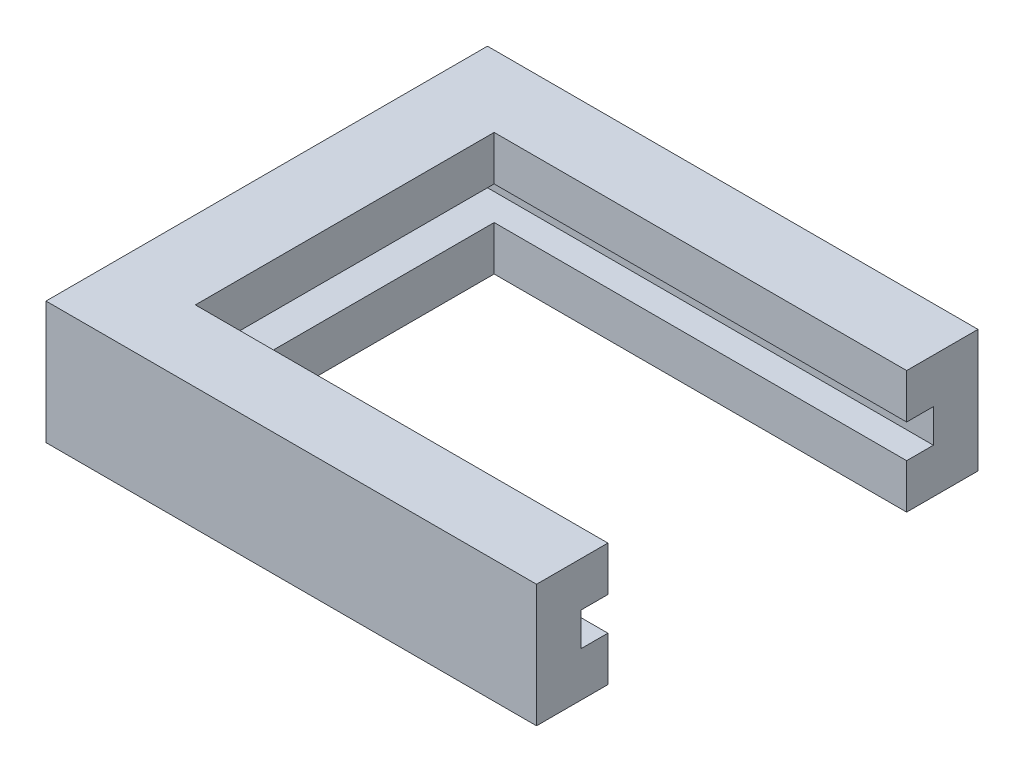
ISO-10303-21;
HEADER;
FILE_DESCRIPTION(('STEP AP214'),'2;1');
FILE_NAME('part.step','',(''),(''),'','','');
FILE_SCHEMA(('AUTOMOTIVE_DESIGN { 1 0 10303 214 1 1 1 1 }'));
ENDSEC;
DATA;
#1=APPLICATION_CONTEXT('core data for automotive mechanical design processes');
#2=APPLICATION_PROTOCOL_DEFINITION('international standard','automotive_design',2000,#1);
#3=PRODUCT_CONTEXT('',#1,'mechanical');
#4=PRODUCT('Part','Part','',(#3));
#5=PRODUCT_RELATED_PRODUCT_CATEGORY('part','',(#4));
#6=PRODUCT_DEFINITION_FORMATION('','',#4);
#7=PRODUCT_DEFINITION_CONTEXT('part definition',#1,'design');
#8=PRODUCT_DEFINITION('design','',#6,#7);
#9=PRODUCT_DEFINITION_SHAPE('','',#8);
#10=(LENGTH_UNIT() NAMED_UNIT(*) SI_UNIT(.MILLI.,.METRE.));
#11=(NAMED_UNIT(*) PLANE_ANGLE_UNIT() SI_UNIT($,.RADIAN.));
#12=(NAMED_UNIT(*) SI_UNIT($,.STERADIAN.) SOLID_ANGLE_UNIT());
#13=UNCERTAINTY_MEASURE_WITH_UNIT(LENGTH_MEASURE(1.E-05),#10,'distance_accuracy_value','');
#14=(GEOMETRIC_REPRESENTATION_CONTEXT(3) GLOBAL_UNCERTAINTY_ASSIGNED_CONTEXT((#13)) GLOBAL_UNIT_ASSIGNED_CONTEXT((#10,
#11,#12)) REPRESENTATION_CONTEXT('',''));
#15=CARTESIAN_POINT('',(0.,0.,0.));
#16=DIRECTION('',(0.,0.,1.));
#17=DIRECTION('',(1.,0.,0.));
#18=AXIS2_PLACEMENT_3D('',#15,#16,#17);
#19=CARTESIAN_POINT('',(20.5,0.,0.));
#20=DIRECTION('',(1.,0.,0.));
#21=DIRECTION('',(0.,0.,-1.));
#22=AXIS2_PLACEMENT_3D('',#19,#20,#21);
#23=PLANE('',#22);
#24=DIRECTION('',(0.,1.,0.));
#25=VECTOR('',#24,1.);
#26=CARTESIAN_POINT('',(20.5,-2.52696358834142,11.4882316718919));
#27=LINE('',#26,#25);
#28=CARTESIAN_POINT('',(20.5,0.97303641165858,11.4882316718919));
#29=VERTEX_POINT('',#28);
#30=CARTESIAN_POINT('',(20.5,2.97303641165858,11.4882316718919));
#31=VERTEX_POINT('',#30);
#32=EDGE_CURVE('E219',#29,#31,#27,.T.);
#33=ORIENTED_EDGE('',*,*,#32,.T.);
#34=DIRECTION('',(0.,0.,1.));
#35=VECTOR('',#34,1.);
#36=CARTESIAN_POINT('',(20.5,2.97303641165858,14.6882316718919));
#37=LINE('',#36,#35);
#38=CARTESIAN_POINT('',(20.5,2.97303641165858,14.6882316718919));
#39=VERTEX_POINT('',#38);
#40=EDGE_CURVE('E296',#31,#39,#37,.T.);
#41=ORIENTED_EDGE('',*,*,#40,.T.);
#42=DIRECTION('',(0.,-1.,0.));
#43=VECTOR('',#42,1.);
#44=CARTESIAN_POINT('',(20.5,2.97303641165858,14.6882316718919));
#45=LINE('',#44,#43);
#46=CARTESIAN_POINT('',(20.5,-2.52696358834142,14.6882316718919));
#47=VERTEX_POINT('',#46);
#48=EDGE_CURVE('E285',#39,#47,#45,.T.);
#49=ORIENTED_EDGE('',*,*,#48,.T.);
#50=DIRECTION('',(0.,0.,-1.));
#51=VECTOR('',#50,1.);
#52=CARTESIAN_POINT('',(20.5,-2.52696358834142,14.6882316718919));
#53=LINE('',#52,#51);
#54=CARTESIAN_POINT('',(20.5,-2.52696358834142,11.4882316718919));
#55=VERTEX_POINT('',#54);
#56=EDGE_CURVE('E290',#47,#55,#53,.T.);
#57=ORIENTED_EDGE('',*,*,#56,.T.);
#58=CARTESIAN_POINT('',(20.5,-0.52696358834142,11.4882316718919));
#59=VERTEX_POINT('',#58);
#60=EDGE_CURVE('E214',#55,#59,#27,.T.);
#61=ORIENTED_EDGE('',*,*,#60,.T.);
#62=DIRECTION('',(0.,0.,-1.));
#63=VECTOR('',#62,1.);
#64=CARTESIAN_POINT('',(20.5,-0.526963588341419,-3.11176832810812));
#65=LINE('',#64,#63);
#66=CARTESIAN_POINT('',(20.5,-0.52696358834142,12.6882316718919));
#67=VERTEX_POINT('',#66);
#68=EDGE_CURVE('E245',#67,#59,#65,.T.);
#69=ORIENTED_EDGE('',*,*,#68,.F.);
#70=DIRECTION('',(0.,-1.,0.));
#71=VECTOR('',#70,1.);
#72=CARTESIAN_POINT('',(20.5,-0.52696358834142,12.6882316718919));
#73=LINE('',#72,#71);
#74=CARTESIAN_POINT('',(20.5,0.97303641165858,12.6882316718919));
#75=VERTEX_POINT('',#74);
#76=EDGE_CURVE('E240',#75,#67,#73,.T.);
#77=ORIENTED_EDGE('',*,*,#76,.F.);
#78=DIRECTION('',(0.,0.,1.));
#79=VECTOR('',#78,1.);
#80=CARTESIAN_POINT('',(20.5,0.97303641165858,12.6882316718919));
#81=LINE('',#80,#79);
#82=EDGE_CURVE('E253',#29,#75,#81,.T.);
#83=ORIENTED_EDGE('',*,*,#82,.F.);
#84=EDGE_LOOP('',(#33,#41,#49,#57,#61,#69,#77,#83));
#85=FACE_BOUND('',#84,.T.);
#86=ADVANCED_FACE('F43',(#85),#23,.T.);
#87=DIRECTION('',(0.,1.,0.));
#88=VECTOR('',#87,1.);
#89=CARTESIAN_POINT('',(20.5,-2.52696358834142,-1.91176832810812));
#90=LINE('',#89,#88);
#91=CARTESIAN_POINT('',(20.5,-2.52696358834142,-1.91176832810812));
#92=VERTEX_POINT('',#91);
#93=CARTESIAN_POINT('',(20.5,-0.526963588341419,-1.91176832810812));
#94=VERTEX_POINT('',#93);
#95=EDGE_CURVE('E59',#92,#94,#90,.T.);
#96=ORIENTED_EDGE('',*,*,#95,.F.);
#97=CARTESIAN_POINT('',(20.5,-2.52696358834142,-5.11176832810812));
#98=VERTEX_POINT('',#97);
#99=EDGE_CURVE('E289',#92,#98,#53,.T.);
#100=ORIENTED_EDGE('',*,*,#99,.T.);
#101=DIRECTION('',(0.,1.,0.));
#102=VECTOR('',#101,1.);
#103=CARTESIAN_POINT('',(20.5,2.97303641165858,-5.11176832810812));
#104=LINE('',#103,#102);
#105=CARTESIAN_POINT('',(20.5,2.97303641165858,-5.11176832810812));
#106=VERTEX_POINT('',#105);
#107=EDGE_CURVE('E163',#98,#106,#104,.T.);
#108=ORIENTED_EDGE('',*,*,#107,.T.);
#109=CARTESIAN_POINT('',(20.5,2.97303641165858,-1.91176832810812));
#110=VERTEX_POINT('',#109);
#111=EDGE_CURVE('E297',#106,#110,#37,.T.);
#112=ORIENTED_EDGE('',*,*,#111,.T.);
#113=CARTESIAN_POINT('',(20.5,0.973036411658581,-1.91176832810812));
#114=VERTEX_POINT('',#113);
#115=EDGE_CURVE('E205',#114,#110,#90,.T.);
#116=ORIENTED_EDGE('',*,*,#115,.F.);
#117=CARTESIAN_POINT('',(20.5,0.973036411658581,-3.11176832810812));
#118=VERTEX_POINT('',#117);
#119=EDGE_CURVE('E254',#118,#114,#81,.T.);
#120=ORIENTED_EDGE('',*,*,#119,.F.);
#121=DIRECTION('',(0.,1.,0.));
#122=VECTOR('',#121,1.);
#123=CARTESIAN_POINT('',(20.5,0.973036411658581,-3.11176832810812));
#124=LINE('',#123,#122);
#125=CARTESIAN_POINT('',(20.5,-0.526963588341419,-3.11176832810812));
#126=VERTEX_POINT('',#125);
#127=EDGE_CURVE('E249',#126,#118,#124,.T.);
#128=ORIENTED_EDGE('',*,*,#127,.F.);
#129=EDGE_CURVE('E243',#94,#126,#65,.T.);
#130=ORIENTED_EDGE('',*,*,#129,.F.);
#131=EDGE_LOOP('',(#96,#100,#108,#112,#116,#120,#128,#130));
#132=FACE_BOUND('',#131,.T.);
#133=ADVANCED_FACE('F324',(#132),#23,.T.);
#134=CARTESIAN_POINT('',(20.5,2.97303641165858,14.6882316718919));
#135=DIRECTION('',(0.,0.,-1.));
#136=DIRECTION('',(-1.,0.,0.));
#137=AXIS2_PLACEMENT_3D('',#134,#135,#136);
#138=PLANE('',#137);
#139=DIRECTION('',(-1.,0.,0.));
#140=VECTOR('',#139,1.);
#141=CARTESIAN_POINT('',(20.5,2.97303641165858,14.6882316718919));
#142=LINE('',#141,#140);
#143=CARTESIAN_POINT('',(-1.5,2.97303641165858,14.6882316718919));
#144=VERTEX_POINT('',#143);
#145=EDGE_CURVE('E301',#39,#144,#142,.T.);
#146=ORIENTED_EDGE('',*,*,#145,.T.);
#147=DIRECTION('',(0.,1.,0.));
#148=VECTOR('',#147,1.);
#149=CARTESIAN_POINT('',(-1.5,2.97303641165858,14.6882316718919));
#150=LINE('',#149,#148);
#151=CARTESIAN_POINT('',(-1.5,-2.52696358834142,14.6882316718919));
#152=VERTEX_POINT('',#151);
#153=EDGE_CURVE('E179',#152,#144,#150,.T.);
#154=ORIENTED_EDGE('',*,*,#153,.F.);
#155=DIRECTION('',(-1.,0.,0.));
#156=VECTOR('',#155,1.);
#157=CARTESIAN_POINT('',(20.5,-2.52696358834142,14.6882316718919));
#158=LINE('',#157,#156);
#159=EDGE_CURVE('E167',#47,#152,#158,.T.);
#160=ORIENTED_EDGE('',*,*,#159,.F.);
#161=ORIENTED_EDGE('',*,*,#48,.F.);
#162=EDGE_LOOP('',(#146,#154,#160,#161));
#163=FACE_BOUND('',#162,.T.);
#164=ADVANCED_FACE('F45',(#163),#138,.F.);
#165=CARTESIAN_POINT('',(20.5,-2.52696358834142,14.6882316718919));
#166=DIRECTION('',(0.,1.,0.));
#167=DIRECTION('',(0.,0.,1.));
#168=AXIS2_PLACEMENT_3D('',#165,#166,#167);
#169=PLANE('',#168);
#170=DIRECTION('',(0.,0.,1.));
#171=VECTOR('',#170,1.);
#172=CARTESIAN_POINT('',(2.,-2.52696358834142,11.4882316718919));
#173=LINE('',#172,#171);
#174=CARTESIAN_POINT('',(2.,-2.52696358834142,-1.91176832810812));
#175=VERTEX_POINT('',#174);
#176=CARTESIAN_POINT('',(2.,-2.52696358834142,11.4882316718919));
#177=VERTEX_POINT('',#176);
#178=EDGE_CURVE('E197',#175,#177,#173,.T.);
#179=ORIENTED_EDGE('',*,*,#178,.T.);
#180=DIRECTION('',(1.,0.,0.));
#181=VECTOR('',#180,1.);
#182=CARTESIAN_POINT('',(20.5,-2.52696358834142,11.4882316718919));
#183=LINE('',#182,#181);
#184=EDGE_CURVE('E201',#177,#55,#183,.T.);
#185=ORIENTED_EDGE('',*,*,#184,.T.);
#186=ORIENTED_EDGE('',*,*,#56,.F.);
#187=ORIENTED_EDGE('',*,*,#159,.T.);
#188=DIRECTION('',(0.,0.,1.));
#189=VECTOR('',#188,1.);
#190=CARTESIAN_POINT('',(-1.5,-2.52696358834142,-5.11176832810812));
#191=LINE('',#190,#189);
#192=CARTESIAN_POINT('',(-1.5,-2.52696358834142,-5.11176832810812));
#193=VERTEX_POINT('',#192);
#194=EDGE_CURVE('E171',#193,#152,#191,.T.);
#195=ORIENTED_EDGE('',*,*,#194,.F.);
#196=DIRECTION('',(-1.,0.,0.));
#197=VECTOR('',#196,1.);
#198=CARTESIAN_POINT('',(20.5,-2.52696358834142,-5.11176832810812));
#199=LINE('',#198,#197);
#200=EDGE_CURVE('E157',#98,#193,#199,.T.);
#201=ORIENTED_EDGE('',*,*,#200,.F.);
#202=ORIENTED_EDGE('',*,*,#99,.F.);
#203=DIRECTION('',(-1.,0.,0.));
#204=VECTOR('',#203,1.);
#205=CARTESIAN_POINT('',(20.5,-2.52696358834142,-1.91176832810812));
#206=LINE('',#205,#204);
#207=EDGE_CURVE('E193',#92,#175,#206,.T.);
#208=ORIENTED_EDGE('',*,*,#207,.T.);
#209=EDGE_LOOP('',(#179,#185,#186,#187,#195,#201,#202,#208));
#210=FACE_BOUND('',#209,.T.);
#211=ADVANCED_FACE('F173',(#210),#169,.F.);
#212=CARTESIAN_POINT('',(20.5,2.97303641165858,-5.11176832810812));
#213=DIRECTION('',(0.,0.,1.));
#214=DIRECTION('',(0.,-1.,0.));
#215=AXIS2_PLACEMENT_3D('',#212,#213,#214);
#216=PLANE('',#215);
#217=ORIENTED_EDGE('',*,*,#200,.T.);
#218=DIRECTION('',(0.,-1.,0.));
#219=VECTOR('',#218,1.);
#220=CARTESIAN_POINT('',(-1.5,2.97303641165858,-5.11176832810812));
#221=LINE('',#220,#219);
#222=CARTESIAN_POINT('',(-1.5,2.97303641165858,-5.11176832810812));
#223=VERTEX_POINT('',#222);
#224=EDGE_CURVE('E162',#223,#193,#221,.T.);
#225=ORIENTED_EDGE('',*,*,#224,.F.);
#226=DIRECTION('',(-1.,0.,0.));
#227=VECTOR('',#226,1.);
#228=CARTESIAN_POINT('',(20.5,2.97303641165858,-5.11176832810812));
#229=LINE('',#228,#227);
#230=EDGE_CURVE('E168',#106,#223,#229,.T.);
#231=ORIENTED_EDGE('',*,*,#230,.F.);
#232=ORIENTED_EDGE('',*,*,#107,.F.);
#233=EDGE_LOOP('',(#217,#225,#231,#232));
#234=FACE_BOUND('',#233,.T.);
#235=ADVANCED_FACE('F159',(#234),#216,.F.);
#236=CARTESIAN_POINT('',(20.5,2.97303641165858,14.6882316718919));
#237=DIRECTION('',(0.,-1.,0.));
#238=DIRECTION('',(0.,0.,-1.));
#239=AXIS2_PLACEMENT_3D('',#236,#237,#238);
#240=PLANE('',#239);
#241=ORIENTED_EDGE('',*,*,#40,.F.);
#242=DIRECTION('',(1.,0.,0.));
#243=VECTOR('',#242,1.);
#244=CARTESIAN_POINT('',(20.5,2.97303641165858,11.4882316718919));
#245=LINE('',#244,#243);
#246=CARTESIAN_POINT('',(2.,2.97303641165858,11.4882316718919));
#247=VERTEX_POINT('',#246);
#248=EDGE_CURVE('E198',#247,#31,#245,.T.);
#249=ORIENTED_EDGE('',*,*,#248,.F.);
#250=DIRECTION('',(0.,0.,1.));
#251=VECTOR('',#250,1.);
#252=CARTESIAN_POINT('',(2.,2.97303641165858,11.4882316718919));
#253=LINE('',#252,#251);
#254=CARTESIAN_POINT('',(2.,2.97303641165858,-1.91176832810812));
#255=VERTEX_POINT('',#254);
#256=EDGE_CURVE('E208',#255,#247,#253,.T.);
#257=ORIENTED_EDGE('',*,*,#256,.F.);
#258=DIRECTION('',(-1.,0.,0.));
#259=VECTOR('',#258,1.);
#260=CARTESIAN_POINT('',(20.5,2.97303641165858,-1.91176832810812));
#261=LINE('',#260,#259);
#262=EDGE_CURVE('E192',#110,#255,#261,.T.);
#263=ORIENTED_EDGE('',*,*,#262,.F.);
#264=ORIENTED_EDGE('',*,*,#111,.F.);
#265=ORIENTED_EDGE('',*,*,#230,.T.);
#266=DIRECTION('',(0.,0.,-1.));
#267=VECTOR('',#266,1.);
#268=CARTESIAN_POINT('',(-1.5,2.97303641165858,-5.11176832810812));
#269=LINE('',#268,#267);
#270=EDGE_CURVE('E184',#144,#223,#269,.T.);
#271=ORIENTED_EDGE('',*,*,#270,.F.);
#272=ORIENTED_EDGE('',*,*,#145,.F.);
#273=EDGE_LOOP('',(#241,#249,#257,#263,#264,#265,#271,#272));
#274=FACE_BOUND('',#273,.T.);
#275=ADVANCED_FACE('F343',(#274),#240,.F.);
#276=CARTESIAN_POINT('',(20.5,-0.52696358834142,12.6882316718919));
#277=DIRECTION('',(0.,0.,-1.));
#278=DIRECTION('',(-1.,0.,0.));
#279=AXIS2_PLACEMENT_3D('',#276,#277,#278);
#280=PLANE('',#279);
#281=DIRECTION('',(0.,-1.,0.));
#282=VECTOR('',#281,1.);
#283=CARTESIAN_POINT('',(0.,-0.52696358834142,12.6882316718919));
#284=LINE('',#283,#282);
#285=CARTESIAN_POINT('',(0.,0.97303641165858,12.6882316718919));
#286=VERTEX_POINT('',#285);
#287=CARTESIAN_POINT('',(0.,-0.52696358834142,12.6882316718919));
#288=VERTEX_POINT('',#287);
#289=EDGE_CURVE('E239',#286,#288,#284,.T.);
#290=ORIENTED_EDGE('',*,*,#289,.F.);
#291=DIRECTION('',(-1.,0.,0.));
#292=VECTOR('',#291,1.);
#293=CARTESIAN_POINT('',(20.5,0.97303641165858,12.6882316718919));
#294=LINE('',#293,#292);
#295=EDGE_CURVE('E258',#75,#286,#294,.T.);
#296=ORIENTED_EDGE('',*,*,#295,.F.);
#297=ORIENTED_EDGE('',*,*,#76,.T.);
#298=DIRECTION('',(-1.,0.,0.));
#299=VECTOR('',#298,1.);
#300=CARTESIAN_POINT('',(20.5,-0.52696358834142,12.6882316718919));
#301=LINE('',#300,#299);
#302=EDGE_CURVE('E281',#67,#288,#301,.T.);
#303=ORIENTED_EDGE('',*,*,#302,.T.);
#304=EDGE_LOOP('',(#290,#296,#297,#303));
#305=FACE_BOUND('',#304,.T.);
#306=ADVANCED_FACE('F356',(#305),#280,.T.);
#307=CARTESIAN_POINT('',(20.5,-0.526963588341419,-3.11176832810812));
#308=DIRECTION('',(0.,1.,0.));
#309=DIRECTION('',(0.,0.,1.));
#310=AXIS2_PLACEMENT_3D('',#307,#308,#309);
#311=PLANE('',#310);
#312=DIRECTION('',(1.,0.,0.));
#313=VECTOR('',#312,1.);
#314=CARTESIAN_POINT('',(20.5,-0.52696358834142,11.4882316718919));
#315=LINE('',#314,#313);
#316=CARTESIAN_POINT('',(2.,-0.52696358834142,11.4882316718919));
#317=VERTEX_POINT('',#316);
#318=EDGE_CURVE('E236',#317,#59,#315,.T.);
#319=ORIENTED_EDGE('',*,*,#318,.F.);
#320=DIRECTION('',(0.,0.,1.));
#321=VECTOR('',#320,1.);
#322=CARTESIAN_POINT('',(2.,-0.526963588341419,-3.11176832810812));
#323=LINE('',#322,#321);
#324=CARTESIAN_POINT('',(2.,-0.526963588341419,-1.91176832810812));
#325=VERTEX_POINT('',#324);
#326=EDGE_CURVE('E233',#325,#317,#323,.T.);
#327=ORIENTED_EDGE('',*,*,#326,.F.);
#328=DIRECTION('',(-1.,0.,0.));
#329=VECTOR('',#328,1.);
#330=CARTESIAN_POINT('',(20.5,-0.526963588341419,-1.91176832810812));
#331=LINE('',#330,#329);
#332=EDGE_CURVE('E218',#94,#325,#331,.T.);
#333=ORIENTED_EDGE('',*,*,#332,.F.);
#334=ORIENTED_EDGE('',*,*,#129,.T.);
#335=DIRECTION('',(-1.,0.,0.));
#336=VECTOR('',#335,1.);
#337=CARTESIAN_POINT('',(20.5,-0.526963588341419,-3.11176832810812));
#338=LINE('',#337,#336);
#339=CARTESIAN_POINT('',(0.,-0.526963588341419,-3.11176832810812));
#340=VERTEX_POINT('',#339);
#341=EDGE_CURVE('E278',#126,#340,#338,.T.);
#342=ORIENTED_EDGE('',*,*,#341,.T.);
#343=DIRECTION('',(0.,0.,-1.));
#344=VECTOR('',#343,1.);
#345=CARTESIAN_POINT('',(0.,-0.526963588341419,-3.11176832810812));
#346=LINE('',#345,#344);
#347=EDGE_CURVE('E262',#288,#340,#346,.T.);
#348=ORIENTED_EDGE('',*,*,#347,.F.);
#349=ORIENTED_EDGE('',*,*,#302,.F.);
#350=ORIENTED_EDGE('',*,*,#68,.T.);
#351=EDGE_LOOP('',(#319,#327,#333,#334,#342,#348,#349,#350));
#352=FACE_BOUND('',#351,.T.);
#353=ADVANCED_FACE('F375',(#352),#311,.T.);
#354=CARTESIAN_POINT('',(20.5,0.973036411658581,-3.11176832810812));
#355=DIRECTION('',(0.,0.,1.));
#356=DIRECTION('',(1.,0.,0.));
#357=AXIS2_PLACEMENT_3D('',#354,#355,#356);
#358=PLANE('',#357);
#359=DIRECTION('',(0.,1.,0.));
#360=VECTOR('',#359,1.);
#361=CARTESIAN_POINT('',(0.,0.973036411658581,-3.11176832810812));
#362=LINE('',#361,#360);
#363=CARTESIAN_POINT('',(0.,0.973036411658581,-3.11176832810812));
#364=VERTEX_POINT('',#363);
#365=EDGE_CURVE('E266',#340,#364,#362,.T.);
#366=ORIENTED_EDGE('',*,*,#365,.F.);
#367=ORIENTED_EDGE('',*,*,#341,.F.);
#368=ORIENTED_EDGE('',*,*,#127,.T.);
#369=DIRECTION('',(-1.,0.,0.));
#370=VECTOR('',#369,1.);
#371=CARTESIAN_POINT('',(20.5,0.973036411658581,-3.11176832810812));
#372=LINE('',#371,#370);
#373=EDGE_CURVE('E275',#118,#364,#372,.T.);
#374=ORIENTED_EDGE('',*,*,#373,.T.);
#375=EDGE_LOOP('',(#366,#367,#368,#374));
#376=FACE_BOUND('',#375,.T.);
#377=ADVANCED_FACE('F382',(#376),#358,.T.);
#378=CARTESIAN_POINT('',(20.5,0.97303641165858,12.6882316718919));
#379=DIRECTION('',(0.,-1.,0.));
#380=DIRECTION('',(0.,0.,-1.));
#381=AXIS2_PLACEMENT_3D('',#378,#379,#380);
#382=PLANE('',#381);
#383=DIRECTION('',(-1.,0.,0.));
#384=VECTOR('',#383,1.);
#385=CARTESIAN_POINT('',(20.5,0.97303641165858,11.4882316718919));
#386=LINE('',#385,#384);
#387=CARTESIAN_POINT('',(2.,0.973036411658581,11.4882316718919));
#388=VERTEX_POINT('',#387);
#389=EDGE_CURVE('E11',#29,#388,#386,.T.);
#390=ORIENTED_EDGE('',*,*,#389,.F.);
#391=ORIENTED_EDGE('',*,*,#82,.T.);
#392=ORIENTED_EDGE('',*,*,#295,.T.);
#393=DIRECTION('',(0.,0.,1.));
#394=VECTOR('',#393,1.);
#395=CARTESIAN_POINT('',(0.,0.97303641165858,12.6882316718919));
#396=LINE('',#395,#394);
#397=EDGE_CURVE('E244',#364,#286,#396,.T.);
#398=ORIENTED_EDGE('',*,*,#397,.F.);
#399=ORIENTED_EDGE('',*,*,#373,.F.);
#400=ORIENTED_EDGE('',*,*,#119,.T.);
#401=DIRECTION('',(1.,0.,0.));
#402=VECTOR('',#401,1.);
#403=CARTESIAN_POINT('',(20.5,0.973036411658581,-1.91176832810812));
#404=LINE('',#403,#402);
#405=CARTESIAN_POINT('',(2.,0.973036411658581,-1.91176832810812));
#406=VERTEX_POINT('',#405);
#407=EDGE_CURVE('E308',#406,#114,#404,.T.);
#408=ORIENTED_EDGE('',*,*,#407,.F.);
#409=DIRECTION('',(0.,0.,-1.));
#410=VECTOR('',#409,1.);
#411=CARTESIAN_POINT('',(2.,0.97303641165858,12.6882316718919));
#412=LINE('',#411,#410);
#413=EDGE_CURVE('E52',#388,#406,#412,.T.);
#414=ORIENTED_EDGE('',*,*,#413,.F.);
#415=EDGE_LOOP('',(#390,#391,#392,#398,#399,#400,#408,#414));
#416=FACE_BOUND('',#415,.T.);
#417=ADVANCED_FACE('F318',(#416),#382,.T.);
#418=CARTESIAN_POINT('',(20.5,-2.52696358834142,-1.91176832810812));
#419=DIRECTION('',(0.,0.,-1.));
#420=DIRECTION('',(-1.,0.,0.));
#421=AXIS2_PLACEMENT_3D('',#418,#419,#420);
#422=PLANE('',#421);
#423=ORIENTED_EDGE('',*,*,#407,.T.);
#424=ORIENTED_EDGE('',*,*,#115,.T.);
#425=ORIENTED_EDGE('',*,*,#262,.T.);
#426=DIRECTION('',(0.,1.,0.));
#427=VECTOR('',#426,1.);
#428=CARTESIAN_POINT('',(2.,-2.52696358834142,-1.91176832810812));
#429=LINE('',#428,#427);
#430=EDGE_CURVE('E67',#406,#255,#429,.T.);
#431=ORIENTED_EDGE('',*,*,#430,.F.);
#432=EDGE_LOOP('',(#423,#424,#425,#431));
#433=FACE_BOUND('',#432,.T.);
#434=ADVANCED_FACE('F321',(#433),#422,.F.);
#435=CARTESIAN_POINT('',(2.,-2.52696358834142,11.4882316718919));
#436=DIRECTION('',(-1.,0.,0.));
#437=DIRECTION('',(0.,0.,1.));
#438=AXIS2_PLACEMENT_3D('',#435,#436,#437);
#439=PLANE('',#438);
#440=ORIENTED_EDGE('',*,*,#413,.T.);
#441=ORIENTED_EDGE('',*,*,#430,.T.);
#442=ORIENTED_EDGE('',*,*,#256,.T.);
#443=DIRECTION('',(0.,1.,0.));
#444=VECTOR('',#443,1.);
#445=CARTESIAN_POINT('',(2.,-2.52696358834142,11.4882316718919));
#446=LINE('',#445,#444);
#447=EDGE_CURVE('E224',#388,#247,#446,.T.);
#448=ORIENTED_EDGE('',*,*,#447,.F.);
#449=EDGE_LOOP('',(#440,#441,#442,#448));
#450=FACE_BOUND('',#449,.T.);
#451=ADVANCED_FACE('F315',(#450),#439,.F.);
#452=CARTESIAN_POINT('',(20.5,-2.52696358834142,11.4882316718919));
#453=DIRECTION('',(0.,0.,1.));
#454=DIRECTION('',(1.,0.,0.));
#455=AXIS2_PLACEMENT_3D('',#452,#453,#454);
#456=PLANE('',#455);
#457=ORIENTED_EDGE('',*,*,#389,.T.);
#458=ORIENTED_EDGE('',*,*,#447,.T.);
#459=ORIENTED_EDGE('',*,*,#248,.T.);
#460=ORIENTED_EDGE('',*,*,#32,.F.);
#461=EDGE_LOOP('',(#457,#458,#459,#460));
#462=FACE_BOUND('',#461,.T.);
#463=ADVANCED_FACE('F411',(#462),#456,.F.);
#464=ORIENTED_EDGE('',*,*,#318,.T.);
#465=ORIENTED_EDGE('',*,*,#60,.F.);
#466=ORIENTED_EDGE('',*,*,#184,.F.);
#467=EDGE_CURVE('E220',#177,#317,#446,.T.);
#468=ORIENTED_EDGE('',*,*,#467,.T.);
#469=EDGE_LOOP('',(#464,#465,#466,#468));
#470=FACE_BOUND('',#469,.T.);
#471=ADVANCED_FACE('F419',(#470),#456,.F.);
#472=ORIENTED_EDGE('',*,*,#326,.T.);
#473=ORIENTED_EDGE('',*,*,#467,.F.);
#474=ORIENTED_EDGE('',*,*,#178,.F.);
#475=EDGE_CURVE('E225',#175,#325,#429,.T.);
#476=ORIENTED_EDGE('',*,*,#475,.T.);
#477=EDGE_LOOP('',(#472,#473,#474,#476));
#478=FACE_BOUND('',#477,.T.);
#479=ADVANCED_FACE('F413',(#478),#439,.F.);
#480=ORIENTED_EDGE('',*,*,#332,.T.);
#481=ORIENTED_EDGE('',*,*,#475,.F.);
#482=ORIENTED_EDGE('',*,*,#207,.F.);
#483=ORIENTED_EDGE('',*,*,#95,.T.);
#484=EDGE_LOOP('',(#480,#481,#482,#483));
#485=FACE_BOUND('',#484,.T.);
#486=ADVANCED_FACE('F404',(#485),#422,.F.);
#487=CARTESIAN_POINT('',(0.,0.,0.));
#488=DIRECTION('',(-1.,0.,0.));
#489=DIRECTION('',(0.,0.,1.));
#490=AXIS2_PLACEMENT_3D('',#487,#488,#489);
#491=PLANE('',#490);
#492=ORIENTED_EDGE('',*,*,#397,.T.);
#493=ORIENTED_EDGE('',*,*,#289,.T.);
#494=ORIENTED_EDGE('',*,*,#347,.T.);
#495=ORIENTED_EDGE('',*,*,#365,.T.);
#496=EDGE_LOOP('',(#492,#493,#494,#495));
#497=FACE_BOUND('',#496,.T.);
#498=ADVANCED_FACE('F439',(#497),#491,.F.);
#499=CARTESIAN_POINT('',(-1.5,0.,0.));
#500=DIRECTION('',(-1.,0.,0.));
#501=DIRECTION('',(0.,0.,1.));
#502=AXIS2_PLACEMENT_3D('',#499,#500,#501);
#503=PLANE('',#502);
#504=ORIENTED_EDGE('',*,*,#224,.T.);
#505=ORIENTED_EDGE('',*,*,#194,.T.);
#506=ORIENTED_EDGE('',*,*,#153,.T.);
#507=ORIENTED_EDGE('',*,*,#270,.T.);
#508=EDGE_LOOP('',(#504,#505,#506,#507));
#509=FACE_BOUND('',#508,.T.);
#510=ADVANCED_FACE('F182',(#509),#503,.T.);
#511=CLOSED_SHELL('',(#86,#133,#164,#211,#235,#275,#306,#353,#377,#417,#434,#451,#463,#471,#479,
#486,#498,#510));
#512=MANIFOLD_SOLID_BREP('B2',#511);
#513=ADVANCED_BREP_SHAPE_REPRESENTATION('',(#18,#512),#14);
#514=SHAPE_DEFINITION_REPRESENTATION(#9,#513);
ENDSEC;
END-ISO-10303-21;
